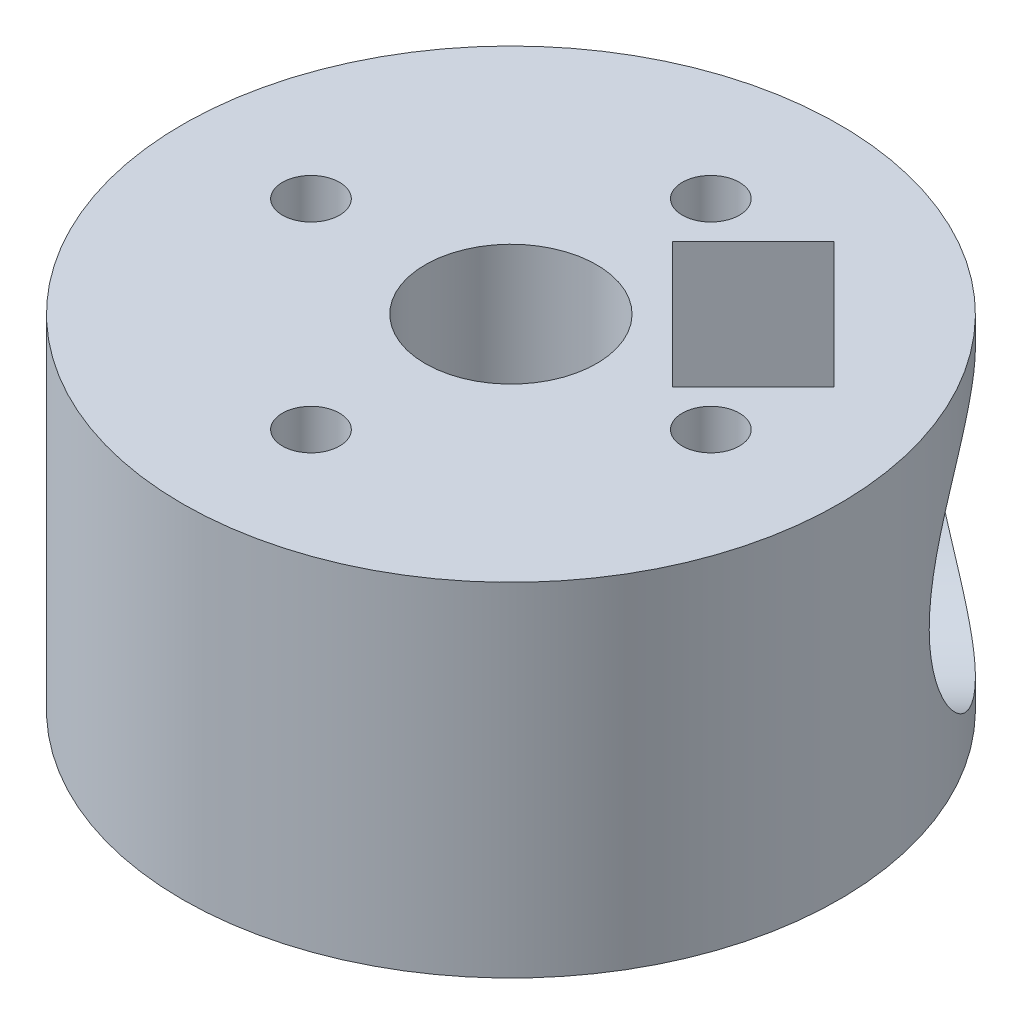
ISO-10303-21;
HEADER;
FILE_DESCRIPTION(('STEP AP214'),'2;1');
FILE_NAME('part.step','',(''),(''),'','','');
FILE_SCHEMA(('AUTOMOTIVE_DESIGN { 1 0 10303 214 1 1 1 1 }'));
ENDSEC;
DATA;
#1=APPLICATION_CONTEXT('core data for automotive mechanical design processes');
#2=APPLICATION_PROTOCOL_DEFINITION('international standard','automotive_design',2000,#1);
#3=PRODUCT_CONTEXT('',#1,'mechanical');
#4=PRODUCT('Part','Part','',(#3));
#5=PRODUCT_RELATED_PRODUCT_CATEGORY('part','',(#4));
#6=PRODUCT_DEFINITION_FORMATION('','',#4);
#7=PRODUCT_DEFINITION_CONTEXT('part definition',#1,'design');
#8=PRODUCT_DEFINITION('design','',#6,#7);
#9=PRODUCT_DEFINITION_SHAPE('','',#8);
#10=(LENGTH_UNIT() NAMED_UNIT(*) SI_UNIT(.MILLI.,.METRE.));
#11=(NAMED_UNIT(*) PLANE_ANGLE_UNIT() SI_UNIT($,.RADIAN.));
#12=(NAMED_UNIT(*) SI_UNIT($,.STERADIAN.) SOLID_ANGLE_UNIT());
#13=UNCERTAINTY_MEASURE_WITH_UNIT(LENGTH_MEASURE(1.E-05),#10,'distance_accuracy_value','');
#14=(GEOMETRIC_REPRESENTATION_CONTEXT(3) GLOBAL_UNCERTAINTY_ASSIGNED_CONTEXT((#13)) GLOBAL_UNIT_ASSIGNED_CONTEXT((#10,
#11,#12)) REPRESENTATION_CONTEXT('',''));
#15=CARTESIAN_POINT('',(0.,0.,0.));
#16=DIRECTION('',(0.,0.,1.));
#17=DIRECTION('',(1.,0.,0.));
#18=AXIS2_PLACEMENT_3D('',#15,#16,#17);
#19=CARTESIAN_POINT('',(1.41421356237309,6.,-1.4142135623731));
#20=DIRECTION('',(0.707106781186546,0.,-0.707106781186549));
#21=DIRECTION('',(-0.707106781186549,0.,-0.707106781186546));
#22=AXIS2_PLACEMENT_3D('',#19,#20,#21);
#23=CYLINDRICAL_SURFACE('',#22,1.5);
#24=CARTESIAN_POINT('',(5.65685424949237,6.,-5.65685424949239));
#25=DIRECTION('',(-0.707106781186546,0.,0.707106781186549));
#26=DIRECTION('',(0.707106781186549,0.,0.707106781186546));
#27=AXIS2_PLACEMENT_3D('',#24,#25,#26);
#28=CIRCLE('',#27,1.5);
#29=CARTESIAN_POINT('',(6.71751442127219,6.,-4.59619407771257));
#30=VERTEX_POINT('',#29);
#31=EDGE_CURVE('E154',#30,#30,#28,.T.);
#32=ORIENTED_EDGE('',*,*,#31,.T.);
#33=EDGE_LOOP('',(#32));
#34=FACE_BOUND('',#33,.T.);
#35=CARTESIAN_POINT('',(7.07106781186546,6.,-7.07106781186549));
#36=DIRECTION('',(0.707106781186546,0.,-0.707106781186549));
#37=DIRECTION('',(-0.707106781186549,0.,-0.707106781186546));
#38=AXIS2_PLACEMENT_3D('',#35,#36,#37);
#39=CIRCLE('',#38,1.5);
#40=CARTESIAN_POINT('',(6.01040764008564,6.,-8.13172798364531));
#41=VERTEX_POINT('',#40);
#42=EDGE_CURVE('E157',#41,#41,#39,.F.);
#43=ORIENTED_EDGE('',*,*,#42,.F.);
#44=EDGE_LOOP('',(#43));
#45=FACE_BOUND('',#44,.T.);
#46=ADVANCED_FACE('F33',(#34,#45),#23,.F.);
#47=CARTESIAN_POINT('',(0.,12.,0.));
#48=DIRECTION('',(0.,1.,0.));
#49=DIRECTION('',(0.,0.,1.));
#50=AXIS2_PLACEMENT_3D('',#47,#48,#49);
#51=PLANE('',#50);
#52=CARTESIAN_POINT('',(3.96862982246381E-13,12.,7.));
#53=DIRECTION('',(0.,1.,0.));
#54=DIRECTION('',(0.,0.,1.));
#55=AXIS2_PLACEMENT_3D('',#52,#53,#54);
#56=CIRCLE('',#55,1.00000000000043);
#57=CARTESIAN_POINT('',(3.96862982246381E-13,12.,8.00000000000043));
#58=VERTEX_POINT('',#57);
#59=EDGE_CURVE('E129',#58,#58,#56,.T.);
#60=ORIENTED_EDGE('',*,*,#59,.F.);
#61=EDGE_LOOP('',(#60));
#62=FACE_BOUND('',#61,.T.);
#63=CARTESIAN_POINT('',(0.,12.,-7.));
#64=DIRECTION('',(0.,1.,0.));
#65=DIRECTION('',(0.,0.,1.));
#66=AXIS2_PLACEMENT_3D('',#63,#64,#65);
#67=CIRCLE('',#66,1.);
#68=CARTESIAN_POINT('',(0.,12.,-6.));
#69=VERTEX_POINT('',#68);
#70=EDGE_CURVE('E141',#69,#69,#67,.T.);
#71=ORIENTED_EDGE('',*,*,#70,.F.);
#72=EDGE_LOOP('',(#71));
#73=FACE_BOUND('',#72,.T.);
#74=CARTESIAN_POINT('',(0.,12.,0.));
#75=DIRECTION('',(0.,1.,0.));
#76=DIRECTION('',(0.,0.,1.));
#77=AXIS2_PLACEMENT_3D('',#74,#75,#76);
#78=CIRCLE('',#77,11.5);
#79=CARTESIAN_POINT('',(0.,12.,11.5));
#80=VERTEX_POINT('',#79);
#81=EDGE_CURVE('E11',#80,#80,#78,.T.);
#82=ORIENTED_EDGE('',*,*,#81,.T.);
#83=EDGE_LOOP('',(#82));
#84=FACE_BOUND('',#83,.T.);
#85=CARTESIAN_POINT('',(0.,12.,0.));
#86=DIRECTION('',(0.,1.,0.));
#87=DIRECTION('',(0.,0.,1.));
#88=AXIS2_PLACEMENT_3D('',#85,#86,#87);
#89=CIRCLE('',#88,3.);
#90=CARTESIAN_POINT('',(0.,12.,3.));
#91=VERTEX_POINT('',#90);
#92=EDGE_CURVE('E147',#91,#91,#89,.T.);
#93=ORIENTED_EDGE('',*,*,#92,.F.);
#94=EDGE_LOOP('',(#93));
#95=FACE_BOUND('',#94,.T.);
#96=CARTESIAN_POINT('',(7.0000000000002,12.,-1.98094713253425E-13));
#97=DIRECTION('',(0.,1.,0.));
#98=DIRECTION('',(0.,0.,1.));
#99=AXIS2_PLACEMENT_3D('',#96,#97,#98);
#100=CIRCLE('',#99,1.00000000000016);
#101=CARTESIAN_POINT('',(7.0000000000002,12.,0.999999999999957));
#102=VERTEX_POINT('',#101);
#103=EDGE_CURVE('E135',#102,#102,#100,.T.);
#104=ORIENTED_EDGE('',*,*,#103,.F.);
#105=EDGE_LOOP('',(#104));
#106=FACE_BOUND('',#105,.T.);
#107=CARTESIAN_POINT('',(-6.9999999999998,12.,1.98951966012828E-13));
#108=DIRECTION('',(0.,1.,0.));
#109=DIRECTION('',(0.,0.,1.));
#110=AXIS2_PLACEMENT_3D('',#107,#108,#109);
#111=CIRCLE('',#110,1.00000000000032);
#112=CARTESIAN_POINT('',(-6.9999999999998,12.,1.00000000000052));
#113=VERTEX_POINT('',#112);
#114=EDGE_CURVE('E123',#113,#113,#111,.T.);
#115=ORIENTED_EDGE('',*,*,#114,.F.);
#116=EDGE_LOOP('',(#115));
#117=FACE_BOUND('',#116,.T.);
#118=DIRECTION('',(0.707106781186549,0.,0.707106781186546));
#119=VECTOR('',#118,1.);
#120=CARTESIAN_POINT('',(5.65685424949237,12.,-5.65685424949239));
#121=LINE('',#120,#119);
#122=CARTESIAN_POINT('',(3.4471455582844,12.,-7.86656294070035));
#123=VERTEX_POINT('',#122);
#124=CARTESIAN_POINT('',(7.86656294070033,12.,-3.44714555828444));
#125=VERTEX_POINT('',#124);
#126=EDGE_CURVE('E113',#123,#125,#121,.T.);
#127=ORIENTED_EDGE('',*,*,#126,.T.);
#128=DIRECTION('',(-0.707106781186546,0.,0.707106781186549));
#129=VECTOR('',#128,1.);
#130=CARTESIAN_POINT('',(2.20970869120797,12.,2.20970869120796));
#131=LINE('',#130,#129);
#132=CARTESIAN_POINT('',(5.03813581595415,12.,-0.61871843353824));
#133=VERTEX_POINT('',#132);
#134=EDGE_CURVE('E54',#125,#133,#131,.T.);
#135=ORIENTED_EDGE('',*,*,#134,.T.);
#136=DIRECTION('',(0.707106781186549,0.,0.707106781186546));
#137=VECTOR('',#136,1.);
#138=CARTESIAN_POINT('',(2.82842712474618,12.,-2.8284271247462));
#139=LINE('',#138,#137);
#140=CARTESIAN_POINT('',(0.61871843353822,12.,-5.03813581595415));
#141=VERTEX_POINT('',#140);
#142=EDGE_CURVE('E97',#141,#133,#139,.T.);
#143=ORIENTED_EDGE('',*,*,#142,.F.);
#144=DIRECTION('',(-0.707106781186546,0.,0.707106781186549));
#145=VECTOR('',#144,1.);
#146=CARTESIAN_POINT('',(-2.20970869120797,12.,-2.20970869120796));
#147=LINE('',#146,#145);
#148=EDGE_CURVE('E100',#123,#141,#147,.T.);
#149=ORIENTED_EDGE('',*,*,#148,.F.);
#150=EDGE_LOOP('',(#127,#135,#143,#149));
#151=FACE_BOUND('',#150,.T.);
#152=ADVANCED_FACE('F186',(#62,#73,#84,#95,#106,#117,#151),#51,.T.);
#153=CARTESIAN_POINT('',(0.,0.,0.));
#154=DIRECTION('',(0.,1.,0.));
#155=DIRECTION('',(0.,0.,1.));
#156=AXIS2_PLACEMENT_3D('',#153,#154,#155);
#157=PLANE('',#156);
#158=CARTESIAN_POINT('',(-6.9999999999998,0.,1.98951966012828E-13));
#159=DIRECTION('',(0.,1.,0.));
#160=DIRECTION('',(0.,0.,1.));
#161=AXIS2_PLACEMENT_3D('',#158,#159,#160);
#162=CIRCLE('',#161,1.00000000000032);
#163=CARTESIAN_POINT('',(-6.9999999999998,0.,1.00000000000052));
#164=VERTEX_POINT('',#163);
#165=EDGE_CURVE('E119',#164,#164,#162,.T.);
#166=ORIENTED_EDGE('',*,*,#165,.T.);
#167=EDGE_LOOP('',(#166));
#168=FACE_BOUND('',#167,.T.);
#169=CARTESIAN_POINT('',(3.96862982246381E-13,0.,7.));
#170=DIRECTION('',(0.,1.,0.));
#171=DIRECTION('',(0.,0.,1.));
#172=AXIS2_PLACEMENT_3D('',#169,#170,#171);
#173=CIRCLE('',#172,1.00000000000043);
#174=CARTESIAN_POINT('',(3.96862982246381E-13,0.,8.00000000000043));
#175=VERTEX_POINT('',#174);
#176=EDGE_CURVE('E126',#175,#175,#173,.T.);
#177=ORIENTED_EDGE('',*,*,#176,.T.);
#178=EDGE_LOOP('',(#177));
#179=FACE_BOUND('',#178,.T.);
#180=CARTESIAN_POINT('',(7.0000000000002,0.,-1.98094713253425E-13));
#181=DIRECTION('',(0.,1.,0.));
#182=DIRECTION('',(0.,0.,1.));
#183=AXIS2_PLACEMENT_3D('',#180,#181,#182);
#184=CIRCLE('',#183,1.00000000000016);
#185=CARTESIAN_POINT('',(7.0000000000002,0.,0.999999999999957));
#186=VERTEX_POINT('',#185);
#187=EDGE_CURVE('E132',#186,#186,#184,.T.);
#188=ORIENTED_EDGE('',*,*,#187,.T.);
#189=EDGE_LOOP('',(#188));
#190=FACE_BOUND('',#189,.T.);
#191=CARTESIAN_POINT('',(0.,0.,-7.));
#192=DIRECTION('',(0.,1.,0.));
#193=DIRECTION('',(0.,0.,1.));
#194=AXIS2_PLACEMENT_3D('',#191,#192,#193);
#195=CIRCLE('',#194,1.);
#196=CARTESIAN_POINT('',(0.,0.,-6.));
#197=VERTEX_POINT('',#196);
#198=EDGE_CURVE('E138',#197,#197,#195,.T.);
#199=ORIENTED_EDGE('',*,*,#198,.T.);
#200=EDGE_LOOP('',(#199));
#201=FACE_BOUND('',#200,.T.);
#202=CARTESIAN_POINT('',(0.,0.,0.));
#203=DIRECTION('',(0.,1.,0.));
#204=DIRECTION('',(0.,0.,1.));
#205=AXIS2_PLACEMENT_3D('',#202,#203,#204);
#206=CIRCLE('',#205,3.);
#207=CARTESIAN_POINT('',(0.,0.,3.));
#208=VERTEX_POINT('',#207);
#209=EDGE_CURVE('E144',#208,#208,#206,.T.);
#210=ORIENTED_EDGE('',*,*,#209,.T.);
#211=EDGE_LOOP('',(#210));
#212=FACE_BOUND('',#211,.T.);
#213=CARTESIAN_POINT('',(0.,0.,0.));
#214=DIRECTION('',(0.,1.,0.));
#215=DIRECTION('',(0.,0.,1.));
#216=AXIS2_PLACEMENT_3D('',#213,#214,#215);
#217=CIRCLE('',#216,11.5);
#218=CARTESIAN_POINT('',(0.,0.,11.5));
#219=VERTEX_POINT('',#218);
#220=EDGE_CURVE('E46',#219,#219,#217,.T.);
#221=ORIENTED_EDGE('',*,*,#220,.F.);
#222=EDGE_LOOP('',(#221));
#223=FACE_BOUND('',#222,.T.);
#224=DIRECTION('',(-0.707106781186546,0.,0.707106781186549));
#225=VECTOR('',#224,1.);
#226=CARTESIAN_POINT('',(2.20970869120797,0.,2.20970869120796));
#227=LINE('',#226,#225);
#228=CARTESIAN_POINT('',(7.86656294070033,0.,-3.44714555828444));
#229=VERTEX_POINT('',#228);
#230=CARTESIAN_POINT('',(5.03813581595415,0.,-0.61871843353824));
#231=VERTEX_POINT('',#230);
#232=EDGE_CURVE('E88',#229,#231,#227,.T.);
#233=ORIENTED_EDGE('',*,*,#232,.F.);
#234=DIRECTION('',(0.707106781186549,0.,0.707106781186546));
#235=VECTOR('',#234,1.);
#236=CARTESIAN_POINT('',(5.65685424949237,0.,-5.65685424949239));
#237=LINE('',#236,#235);
#238=CARTESIAN_POINT('',(3.4471455582844,0.,-7.86656294070035));
#239=VERTEX_POINT('',#238);
#240=EDGE_CURVE('E80',#239,#229,#237,.T.);
#241=ORIENTED_EDGE('',*,*,#240,.F.);
#242=DIRECTION('',(-0.707106781186546,0.,0.707106781186549));
#243=VECTOR('',#242,1.);
#244=CARTESIAN_POINT('',(-2.20970869120797,0.,-2.20970869120796));
#245=LINE('',#244,#243);
#246=CARTESIAN_POINT('',(0.61871843353822,0.,-5.03813581595415));
#247=VERTEX_POINT('',#246);
#248=EDGE_CURVE('E62',#239,#247,#245,.T.);
#249=ORIENTED_EDGE('',*,*,#248,.T.);
#250=DIRECTION('',(0.707106781186549,0.,0.707106781186546));
#251=VECTOR('',#250,1.);
#252=CARTESIAN_POINT('',(2.82842712474618,0.,-2.8284271247462));
#253=LINE('',#252,#251);
#254=EDGE_CURVE('E92',#247,#231,#253,.T.);
#255=ORIENTED_EDGE('',*,*,#254,.T.);
#256=EDGE_LOOP('',(#233,#241,#249,#255));
#257=FACE_BOUND('',#256,.T.);
#258=ADVANCED_FACE('F95',(#168,#179,#190,#201,#212,#223,#257),#157,.F.);
#259=CARTESIAN_POINT('',(0.,12.,0.));
#260=DIRECTION('',(0.,-1.,0.));
#261=DIRECTION('',(0.,0.,-1.));
#262=AXIS2_PLACEMENT_3D('',#259,#260,#261);
#263=CYLINDRICAL_SURFACE('',#262,11.5);
#264=CARTESIAN_POINT('',(3.78737535200564,6.,-10.8584431638711));
#265=CARTESIAN_POINT('',(3.78737687744004,5.86721367544331,-10.8584432302089));
#266=CARTESIAN_POINT('',(3.79293321073784,5.73438715301474,-10.8565095495698));
#267=CARTESIAN_POINT('',(3.81505823777842,5.46971112375947,-10.8487540084161));
#268=CARTESIAN_POINT('',(3.83163371083152,5.33786226894867,-10.8429297542916));
#269=CARTESIAN_POINT('',(3.87552590130048,5.07592596729272,-10.8273192223792));
#270=CARTESIAN_POINT('',(3.90286434032583,4.94584263625513,-10.8175249311491));
#271=CARTESIAN_POINT('',(3.9677912237892,4.68858833953484,-10.7938790259039));
#272=CARTESIAN_POINT('',(4.00538400533308,4.5614186309041,-10.7800256949211));
#273=CARTESIAN_POINT('',(4.08997638395233,4.31146352157035,-10.7482148334112));
#274=CARTESIAN_POINT('',(4.13693011934463,4.18866005711802,-10.7302772540427));
#275=CARTESIAN_POINT('',(4.2396339601799,3.94749697808217,-10.6901142975366));
#276=CARTESIAN_POINT('',(4.2953873854108,3.82913906158126,-10.6678873014579));
#277=CARTESIAN_POINT('',(4.47464040471465,3.48185276723528,-10.5945389924449));
#278=CARTESIAN_POINT('',(4.61023617450071,3.26041345113585,-10.5367135956214));
#279=CARTESIAN_POINT('',(4.91627079405315,2.8293268968776,-10.3976066261771));
#280=CARTESIAN_POINT('',(5.08834157237044,2.62124657641373,-10.3150994660101));
#281=CARTESIAN_POINT('',(5.45419762366187,2.23695387934173,-10.1263991871386));
#282=CARTESIAN_POINT('',(5.64799166234894,2.06075444273752,-10.0201964896288));
#283=CARTESIAN_POINT('',(5.95387331727454,1.82007796735817,-9.83953311425247));
#284=CARTESIAN_POINT('',(6.06100560432311,1.74231014221498,-9.77398471195223));
#285=CARTESIAN_POINT('',(6.27799752445804,1.59741634111028,-9.63603851876587));
#286=CARTESIAN_POINT('',(6.38785599378365,1.5302859116282,-9.56364361465955));
#287=CARTESIAN_POINT('',(6.60918034625239,1.40727439881845,-9.41205258846386));
#288=CARTESIAN_POINT('',(6.72064634733438,1.35139414542181,-9.33285596522268));
#289=CARTESIAN_POINT('',(6.94396363689881,1.25149004381348,-9.1679125051226));
#290=CARTESIAN_POINT('',(7.05581469860376,1.20746013291621,-9.08216904658652));
#291=CARTESIAN_POINT('',(7.27256133966446,1.13384129321487,-8.90943184442934));
#292=CARTESIAN_POINT('',(7.3774975876979,1.10358506388163,-8.82277323936267));
#293=CARTESIAN_POINT('',(7.58567579781886,1.05441823318835,-8.64443724894539));
#294=CARTESIAN_POINT('',(7.6889185083036,1.0355024813419,-8.5527621625984));
#295=CARTESIAN_POINT('',(7.89279060287613,1.00922281790837,-8.36499008707933));
#296=CARTESIAN_POINT('',(7.99342042015829,1.00185697926644,-8.26889383831437));
#297=CARTESIAN_POINT('',(8.19120493527918,0.998761472378054,-8.07301247962711));
#298=CARTESIAN_POINT('',(8.28835978219572,1.00303130434792,-7.97322752832622));
#299=CARTESIAN_POINT('',(8.47210019324658,1.0224833451559,-7.77755231381731));
#300=CARTESIAN_POINT('',(8.55895912849268,1.03692176615685,-7.6818437014221));
#301=CARTESIAN_POINT('',(8.7284701803399,1.075745164492,-7.48867995121926));
#302=CARTESIAN_POINT('',(8.81112090294056,1.10013341397482,-7.39122424894507));
#303=CARTESIAN_POINT('',(8.97173320547294,1.15860838494433,-7.1954168919098));
#304=CARTESIAN_POINT('',(9.04969633319406,1.19269188363189,-7.09706554536849));
#305=CARTESIAN_POINT('',(9.20066297784026,1.27023624451878,-6.90023366008075));
#306=CARTESIAN_POINT('',(9.27366459140153,1.31370067908264,-6.80175308636257));
#307=CARTESIAN_POINT('',(9.48696188150925,1.4590676204919,-6.50441584311125));
#308=CARTESIAN_POINT('',(9.61924633991019,1.57509603955706,-6.30649774787668));
#309=CARTESIAN_POINT('',(9.8617578605947,1.84078921845846,-5.92013202027943));
#310=CARTESIAN_POINT('',(9.97197691812261,1.99046614344851,-5.73168784330734));
#311=CARTESIAN_POINT('',(10.1786295515564,2.33236858824338,-5.35674299265472));
#312=CARTESIAN_POINT('',(10.2733857331568,2.52695876492468,-5.17147154429644));
#313=CARTESIAN_POINT('',(10.4398583925741,2.94674191157694,-4.82660416574328));
#314=CARTESIAN_POINT('',(10.5115643525057,3.17194878553589,-4.66701997325523));
#315=CARTESIAN_POINT('',(10.6043501573388,3.53339348060299,-4.45019935172785));
#316=CARTESIAN_POINT('',(10.6332065477813,3.66042827552803,-4.38061239285826));
#317=CARTESIAN_POINT('',(10.6854446902352,3.920618408913,-4.25160107741005));
#318=CARTESIAN_POINT('',(10.7088287059562,4.05377118923306,-4.19217252144563));
#319=CARTESIAN_POINT('',(10.7503426409733,4.32526407423334,-4.08453969409401));
#320=CARTESIAN_POINT('',(10.7684747684834,4.46360197106106,-4.03633070699636));
#321=CARTESIAN_POINT('',(10.7996897919347,4.74448493075656,-3.95205320321039));
#322=CARTESIAN_POINT('',(10.812773186634,4.88702957654642,-3.91598348734364));
#323=CARTESIAN_POINT('',(10.8333056622908,5.16522836352021,-3.85880109310167));
#324=CARTESIAN_POINT('',(10.8410802577236,5.30068249765708,-3.83683061748985));
#325=CARTESIAN_POINT('',(10.8524559181639,5.57314282063746,-3.80453628907254));
#326=CARTESIAN_POINT('',(10.8560573030858,5.71014888969792,-3.79421154351791));
#327=CARTESIAN_POINT('',(10.8591236987814,5.98454185161798,-3.78542657818588));
#328=CARTESIAN_POINT('',(10.858590079267,6.12192860330409,-3.78696242960866));
#329=CARTESIAN_POINT('',(10.8533845200918,6.39597503128938,-3.80185559445022));
#330=CARTESIAN_POINT('',(10.8487127286786,6.53263473345825,-3.81521248438684));
#331=CARTESIAN_POINT('',(10.8356748439743,6.79423732538208,-3.85207765899575));
#332=CARTESIAN_POINT('',(10.8276021554153,6.91930948531488,-3.87477696282243));
#333=CARTESIAN_POINT('',(10.8077882112033,7.16705999700827,-3.92970147456106));
#334=CARTESIAN_POINT('',(10.7960457855284,7.28973757203145,-3.96192972040745));
#335=CARTESIAN_POINT('',(10.7551707476803,7.65296788495639,-4.07216575226065));
#336=CARTESIAN_POINT('',(10.7203811467114,7.88891151249165,-4.16375312013894));
#337=CARTESIAN_POINT('',(10.6328150622012,8.35292442809324,-4.38265126631863));
#338=CARTESIAN_POINT('',(10.5793143663093,8.58019018552211,-4.511356825067));
#339=CARTESIAN_POINT('',(10.4532659813711,9.0110422534181,-4.79619730775062));
#340=CARTESIAN_POINT('',(10.3807095597208,9.21461764549664,-4.95234479652579));
#341=CARTESIAN_POINT('',(10.2074182916849,9.6114888329872,-5.30091047521197));
#342=CARTESIAN_POINT('',(10.1047331862008,9.80220457559978,-5.49532926199688));
#343=CARTESIAN_POINT('',(9.9312735622845,10.0600651110857,-5.79944177189412));
#344=CARTESIAN_POINT('',(9.87017110336493,10.1413580778674,-5.90296139349613));
#345=CARTESIAN_POINT('',(9.74137016977195,10.293977454773,-6.11317146699841));
#346=CARTESIAN_POINT('',(9.67367456277942,10.3653081653977,-6.21986052644681));
#347=CARTESIAN_POINT('',(9.53119428855228,10.4978637943352,-6.43608721565741));
#348=CARTESIAN_POINT('',(9.45636455664987,10.559016714135,-6.54563927997171));
#349=CARTESIAN_POINT('',(9.30016444367699,10.6700207046688,-6.7657325452552));
#350=CARTESIAN_POINT('',(9.21879692989206,10.7198766936618,-6.87627329391577));
#351=CARTESIAN_POINT('',(9.04979928919305,10.8077686920851,-7.09721561287153));
#352=CARTESIAN_POINT('',(8.96217112367202,10.8458083836314,-7.20761721582475));
#353=CARTESIAN_POINT('',(8.78108176655837,10.9096371958746,-7.42716931745425));
#354=CARTESIAN_POINT('',(8.68762106262647,10.9354273392124,-7.5363199198263));
#355=CARTESIAN_POINT('',(8.50271665058163,10.9729680631498,-7.74413839202284));
#356=CARTESIAN_POINT('',(8.4116491180022,10.9856280084666,-7.84297764251519));
#357=CARTESIAN_POINT('',(8.22564696791436,11.0000552641035,-8.0378403134167));
#358=CARTESIAN_POINT('',(8.13071106495634,11.0018189234082,-8.13386277928198));
#359=CARTESIAN_POINT('',(7.93778701820546,10.994424406382,-8.32224153968746));
#360=CARTESIAN_POINT('',(7.83980063184466,10.9852724093458,-8.41459987790054));
#361=CARTESIAN_POINT('',(7.64149914027405,10.9561570899227,-8.59508434522409));
#362=CARTESIAN_POINT('',(7.54118318284757,10.9361897494175,-8.6832088881385));
#363=CARTESIAN_POINT('',(7.34332702214111,10.8867100552783,-8.85108285110236));
#364=CARTESIAN_POINT('',(7.24584493820593,10.8576293045971,-8.93102816919398));
#365=CARTESIAN_POINT('',(7.05034882534118,10.790019301731,-9.0861537386286));
#366=CARTESIAN_POINT('',(6.95233462325253,10.7514867680836,-9.16133232362872));
#367=CARTESIAN_POINT('',(6.65874536047574,10.622213935834,-9.37924828730865));
#368=CARTESIAN_POINT('',(6.46345997888474,10.5177571284495,-9.51450351516155));
#369=CARTESIAN_POINT('',(6.07155834016298,10.2700543404893,-9.76951677072245));
#370=CARTESIAN_POINT('',(5.87529007671924,10.1252521482122,-9.8882824734374));
#371=CARTESIAN_POINT('',(5.49755333656927,9.8031608570199,-10.1031765213194));
#372=CARTESIAN_POINT('',(5.31609092918046,9.62585853115835,-10.199295613208));
#373=CARTESIAN_POINT('',(4.96172767187941,9.22800079509796,-10.3765798613989));
#374=CARTESIAN_POINT('',(4.7904909012279,9.00519815386177,-10.4560817877621));
#375=CARTESIAN_POINT('',(4.55859389265138,8.64999061974762,-10.5582385437719));
#376=CARTESIAN_POINT('',(4.48540149967959,8.52797153460714,-10.5894612525544));
#377=CARTESIAN_POINT('',(4.34837783830249,8.27759196725381,-10.6464597921683));
#378=CARTESIAN_POINT('',(4.28454232165914,8.1492343984694,-10.6722380972432));
#379=CARTESIAN_POINT('',(4.16720227942496,7.88684191648256,-10.7186013723409));
#380=CARTESIAN_POINT('',(4.11370675341583,7.75280218031389,-10.7391818230597));
#381=CARTESIAN_POINT('',(4.01810310202655,7.48012455117603,-10.7753172061965));
#382=CARTESIAN_POINT('',(3.97598931400375,7.34148898341211,-10.7908746384194));
#383=CARTESIAN_POINT('',(3.90406157227898,7.0610059233453,-10.8171053232745));
#384=CARTESIAN_POINT('',(3.87421527246083,6.91916793167065,-10.8277914285369));
#385=CARTESIAN_POINT('',(3.82733226434902,6.63319105158952,-10.8444526993945));
#386=CARTESIAN_POINT('',(3.8102858152228,6.4890539982822,-10.850431447511));
#387=CARTESIAN_POINT('',(3.7956779009357,6.28713774853353,-10.8555442766418));
#388=CARTESIAN_POINT('',(3.79256608745703,6.22976319619201,-10.8566314739004));
#389=CARTESIAN_POINT('',(3.78841446199447,6.11492827342879,-10.8580809104744));
#390=CARTESIAN_POINT('',(3.78737469182084,6.05746790129881,-10.8584431351612));
#391=CARTESIAN_POINT('',(3.78737535200564,6.,-10.8584431638711));
#392=B_SPLINE_CURVE_WITH_KNOTS('',3,(#264,#265,#266,#267,#268,#269,#270,#271,#272,#273,#274,
#275,#276,#277,#278,#279,#280,#281,#282,#283,#284,#285,#286,#287,#288,#289,#290,#291,#292,#293,
#294,#295,#296,#297,#298,#299,#300,#301,#302,#303,#304,#305,#306,#307,#308,#309,#310,#311,#312,
#313,#314,#315,#316,#317,#318,#319,#320,#321,#322,#323,#324,#325,#326,#327,#328,#329,#330,#331,
#332,#333,#334,#335,#336,#337,#338,#339,#340,#341,#342,#343,#344,#345,#346,#347,#348,#349,#350,
#351,#352,#353,#354,#355,#356,#357,#358,#359,#360,#361,#362,#363,#364,#365,#366,#367,#368,#369,
#370,#371,#372,#373,#374,#375,#376,#377,#378,#379,#380,#381,#382,#383,#384,#385,#386,#387,#388,
#389,#390,#391),.UNSPECIFIED.,.T.,.F.,(4,2,2,2,2,2,2,2,2,2,2,2,2,2,2,2,2,2,2,2,2,2,2,2,2,2,2,2,
2,2,2,2,2,2,2,2,2,2,2,2,2,2,2,2,2,2,2,2,2,2,2,2,2,2,2,2,2,2,2,2,2,2,2,4),(0.,0.398299323730929,
0.796843920394837,1.1961970095886,1.59571926901091,1.99333025057608,2.39109159576241,
3.18567129502025,4.02920240955863,4.87307513724939,5.3157698675023,5.75827876382173,
6.20082029228858,6.64313498239574,7.06083406732191,7.47834330253271,7.89578287065407,
8.31320450889439,8.70289551473386,9.09271477967603,9.48240461586426,9.87224311293028,
10.6630359649453,11.4541151783257,12.3051368122687,13.1565462205247,13.5991419155385,
14.0415542009377,14.4837801983065,14.9259624975293,15.3377453530155,15.7494966395246,
16.1611115400679,16.5727116953321,16.9543756065375,17.3361613279564,18.0991530102751,
18.8957235953231,19.6926598610183,20.5614210229826,20.9963412516732,21.4310731500922,
21.8687604715412,22.3062568726893,22.7436168070374,23.1809402224236,23.5854012791666,
23.9899978512151,24.3943654919725,24.7988834666109,25.1865743697392,25.5744000620702,
26.3494057657736,27.1598743875405,27.9706735901849,28.8423107452586,29.2788939510519,
29.7152783198856,30.1520408094568,30.5885855992394,31.0239718355357,31.4590264011908,
31.6314008113172,31.8037786996274),.UNSPECIFIED.);
#393=CARTESIAN_POINT('',(3.78737535200564,6.,-10.8584431638711));
#394=VERTEX_POINT('',#393);
#395=EDGE_CURVE('E38',#394,#394,#392,.T.);
#396=ORIENTED_EDGE('',*,*,#395,.T.);
#397=EDGE_LOOP('',(#396));
#398=FACE_BOUND('',#397,.T.);
#399=ORIENTED_EDGE('',*,*,#81,.F.);
#400=EDGE_LOOP('',(#399));
#401=FACE_BOUND('',#400,.T.);
#402=ORIENTED_EDGE('',*,*,#220,.T.);
#403=EDGE_LOOP('',(#402));
#404=FACE_BOUND('',#403,.T.);
#405=ADVANCED_FACE('F35',(#398,#401,#404),#263,.T.);
#406=CARTESIAN_POINT('',(0.,12.,0.));
#407=DIRECTION('',(0.,-1.,0.));
#408=DIRECTION('',(0.,0.,-1.));
#409=AXIS2_PLACEMENT_3D('',#406,#407,#408);
#410=CYLINDRICAL_SURFACE('',#409,3.);
#411=CARTESIAN_POINT('',(0.776457135307557,6.,-2.89777747886721));
#412=CARTESIAN_POINT('',(0.776465807945199,5.92183828770712,-2.89777843642086));
#413=CARTESIAN_POINT('',(0.783337885586091,5.84357788271243,-2.89596075365292));
#414=CARTESIAN_POINT('',(0.810238787422548,5.68945910298427,-2.88854556363685));
#415=CARTESIAN_POINT('',(0.830295257550596,5.61360612743489,-2.88294011324794));
#416=CARTESIAN_POINT('',(0.881825990933501,5.46682250348409,-2.86759385571556));
#417=CARTESIAN_POINT('',(0.913239525995616,5.39586802128962,-2.85787499736417));
#418=CARTESIAN_POINT('',(0.985522074791564,5.25986369700492,-2.83375960105534));
#419=CARTESIAN_POINT('',(1.02639160004347,5.19481417460631,-2.81936281002992));
#420=CARTESIAN_POINT('',(1.11931695974479,5.06654140716374,-2.78384605508351));
#421=CARTESIAN_POINT('',(1.17201739854081,5.00391129648968,-2.7622695134035));
#422=CARTESIAN_POINT('',(1.28389309696414,4.88788741738994,-2.7120800954357));
#423=CARTESIAN_POINT('',(1.3430715624082,4.83449825612472,-2.68346372649268));
#424=CARTESIAN_POINT('',(1.4697835351575,4.73494927327851,-2.61633504151045));
#425=CARTESIAN_POINT('',(1.53761134146162,4.6895193482107,-2.57728569203884));
#426=CARTESIAN_POINT('',(1.67515420911278,4.61228872013136,-2.4900743247597));
#427=CARTESIAN_POINT('',(1.74486804977895,4.58047941579424,-2.44191808567333));
#428=CARTESIAN_POINT('',(1.87817425418938,4.53374300804835,-2.34071742954988));
#429=CARTESIAN_POINT('',(1.94184923030434,4.5177757104667,-2.28826464060799));
#430=CARTESIAN_POINT('',(2.06564121032913,4.49975082198744,-2.1771603544596));
#431=CARTESIAN_POINT('',(2.12576034519837,4.49768481480643,-2.11851262971613));
#432=CARTESIAN_POINT('',(2.23530137136982,4.50712001095552,-2.00231140292521));
#433=CARTESIAN_POINT('',(2.28519887174932,4.51745702328183,-1.94510625043173));
#434=CARTESIAN_POINT('',(2.37912040040672,4.54932126585699,-1.82903282067121));
#435=CARTESIAN_POINT('',(2.42314398886575,4.57084933346433,-1.77016441926512));
#436=CARTESIAN_POINT('',(2.50530608030927,4.62462384913472,-1.65187898356768));
#437=CARTESIAN_POINT('',(2.54335473361967,4.6570144697581,-1.59246562724668));
#438=CARTESIAN_POINT('',(2.6127806933699,4.73139512430224,-1.47580220064366));
#439=CARTESIAN_POINT('',(2.64415560358889,4.77338859495352,-1.41855291342132));
#440=CARTESIAN_POINT('',(2.70321718660422,4.87034302729952,-1.30277736945864));
#441=CARTESIAN_POINT('',(2.7302748716661,4.92615454248901,-1.2446419510183));
#442=CARTESIAN_POINT('',(2.77749540009896,5.04688458739527,-1.13537205134786));
#443=CARTESIAN_POINT('',(2.79765294762601,5.11181005841109,-1.08424296543309));
#444=CARTESIAN_POINT('',(2.83296699306693,5.25397228863613,-0.988467637856783));
#445=CARTESIAN_POINT('',(2.84772461492292,5.33172903458132,-0.944439272066024));
#446=CARTESIAN_POINT('',(2.87128516634125,5.4944065070385,-0.870203141463107));
#447=CARTESIAN_POINT('',(2.88009431275189,5.57931964952634,-0.839980958308256));
#448=CARTESIAN_POINT('',(2.8920242052622,5.74682176692419,-0.797898740855287));
#449=CARTESIAN_POINT('',(2.89554041189933,5.82906167856533,-0.784773377993312));
#450=CARTESIAN_POINT('',(2.89846195751578,5.99460201227481,-0.773923684249228));
#451=CARTESIAN_POINT('',(2.89787020033614,6.07790164367968,-0.776188474338468));
#452=CARTESIAN_POINT('',(2.89282271219332,6.23348087786809,-0.79476043293404));
#453=CARTESIAN_POINT('',(2.88879674637904,6.30596917666189,-0.809504390277581));
#454=CARTESIAN_POINT('',(2.87718549622091,6.44755167940644,-0.849847525365753));
#455=CARTESIAN_POINT('',(2.86959905914146,6.51664477611991,-0.875450218468111));
#456=CARTESIAN_POINT('',(2.85000428601381,6.65311699635404,-0.937320913584773));
#457=CARTESIAN_POINT('',(2.83780742241691,6.72026852528033,-0.974027961374807));
#458=CARTESIAN_POINT('',(2.80846718922543,6.84820390730849,-1.05564763070854));
#459=CARTESIAN_POINT('',(2.79132127696574,6.90898446526992,-1.10056446582025));
#460=CARTESIAN_POINT('',(2.74893115939282,7.03046815128532,-1.20283404947151));
#461=CARTESIAN_POINT('',(2.72293857041294,7.09019572607649,-1.26104068458325));
#462=CARTESIAN_POINT('',(2.66304918010131,7.19911835699039,-1.38303494861758));
#463=CARTESIAN_POINT('',(2.62914971686414,7.24830985534581,-1.44682445252411));
#464=CARTESIAN_POINT('',(2.55189425785636,7.33586058892515,-1.57919386501898));
#465=CARTESIAN_POINT('',(2.50831229866665,7.37389967731637,-1.64785576996501));
#466=CARTESIAN_POINT('',(2.41231873467998,7.43570685578609,-1.78542113059001));
#467=CARTESIAN_POINT('',(2.35991493507781,7.45948747704946,-1.85432432047735));
#468=CARTESIAN_POINT('',(2.25247602694357,7.49005284626199,-1.98311144359732));
#469=CARTESIAN_POINT('',(2.19812351338379,7.49819681381417,-2.04324285223116));
#470=CARTESIAN_POINT('',(2.08451046937594,7.5012648981816,-2.15902393796182));
#471=CARTESIAN_POINT('',(2.02525166408007,7.49619364278535,-2.21467517691624));
#472=CARTESIAN_POINT('',(1.90791731594303,7.47387538980656,-2.31635207595354));
#473=CARTESIAN_POINT('',(1.85002110919702,7.45745272611349,-2.36277036625902));
#474=CARTESIAN_POINT('',(1.73362251777721,7.41400950104554,-2.44945348099618));
#475=CARTESIAN_POINT('',(1.67512004734522,7.38698741985982,-2.48971742182762));
#476=CARTESIAN_POINT('',(1.5568750791499,7.32190942175104,-2.5654004226216));
#477=CARTESIAN_POINT('',(1.49718656380225,7.28343101518824,-2.60053861020872));
#478=CARTESIAN_POINT('',(1.38109270507128,7.19706310371143,-2.66401345602037));
#479=CARTESIAN_POINT('',(1.32468888511395,7.14916927632649,-2.69234697700719));
#480=CARTESIAN_POINT('',(1.21166858581717,7.03980429146595,-2.74520076947935));
#481=CARTESIAN_POINT('',(1.15558958126822,6.97745626878421,-2.76906092274574));
#482=CARTESIAN_POINT('',(1.05214039162086,6.84382391830535,-2.81000068113221));
#483=CARTESIAN_POINT('',(1.00477791984151,6.77253176869848,-2.8270742961439));
#484=CARTESIAN_POINT('',(0.920191613571822,6.62004503012857,-2.85575022521723));
#485=CARTESIAN_POINT('',(0.88333547926552,6.5386087033069,-2.86716258468163));
#486=CARTESIAN_POINT('',(0.824963295294618,6.37000139349033,-2.88450805289951));
#487=CARTESIAN_POINT('',(0.803395954954616,6.28285066663097,-2.89045950183027));
#488=CARTESIAN_POINT('',(0.785870399492763,6.16229196652201,-2.89524136224008));
#489=CARTESIAN_POINT('',(0.782348442320766,6.12994815840318,-2.89619347565166));
#490=CARTESIAN_POINT('',(0.777639926487402,6.06507527897664,-2.89746135588973));
#491=CARTESIAN_POINT('',(0.776453524059144,6.03254619542119,-2.89777708014605));
#492=CARTESIAN_POINT('',(0.776457135307557,6.,-2.89777747886721));
#493=B_SPLINE_CURVE_WITH_KNOTS('',3,(#411,#412,#413,#414,#415,#416,#417,#418,#419,#420,#421,
#422,#423,#424,#425,#426,#427,#428,#429,#430,#431,#432,#433,#434,#435,#436,#437,#438,#439,#440,
#441,#442,#443,#444,#445,#446,#447,#448,#449,#450,#451,#452,#453,#454,#455,#456,#457,#458,#459,
#460,#461,#462,#463,#464,#465,#466,#467,#468,#469,#470,#471,#472,#473,#474,#475,#476,#477,#478,
#479,#480,#481,#482,#483,#484,#485,#486,#487,#488,#489,#490,#491,#492),.UNSPECIFIED.,.T.,.F.,(4,
2,2,2,2,2,2,2,2,2,2,2,2,2,2,2,2,2,2,2,2,2,2,2,2,2,2,2,2,2,2,2,2,2,2,2,2,2,2,2,4),(0.,
0.234348183892073,0.469189339237207,0.702792893878329,0.936409088167725,1.18929346874735,
1.44230356626556,1.71236838358145,1.98226240445837,2.23295227451903,2.4834903552906,
2.71224146226808,2.94100968776183,3.1729430209672,3.40495949025408,3.65890787185336,
3.91305072368878,4.18333262594173,4.45333161317557,4.70193436281317,4.95036139782559,
5.17161275136038,5.39293578654094,5.62450944609131,5.85620229330071,6.1171011537092,
6.37808797467303,6.64596272119449,6.91360169713157,7.1566840558423,7.39968130190957,
7.62666637307239,7.85368400268019,8.09041126079208,8.32724745151078,8.58765362775101,
8.84828914267731,9.11716123557907,9.3851269950414,9.48270202777964,9.58028358741811),.UNSPECIFIED.);
#494=CARTESIAN_POINT('',(0.776457135307557,6.,-2.89777747886721));
#495=VERTEX_POINT('',#494);
#496=EDGE_CURVE('E103',#495,#495,#493,.T.);
#497=ORIENTED_EDGE('',*,*,#496,.F.);
#498=EDGE_LOOP('',(#497));
#499=FACE_BOUND('',#498,.T.);
#500=ORIENTED_EDGE('',*,*,#92,.T.);
#501=EDGE_LOOP('',(#500));
#502=FACE_BOUND('',#501,.T.);
#503=ORIENTED_EDGE('',*,*,#209,.F.);
#504=EDGE_LOOP('',(#503));
#505=FACE_BOUND('',#504,.T.);
#506=ADVANCED_FACE('F176',(#499,#502,#505),#410,.F.);
#507=CARTESIAN_POINT('',(0.,12.,-7.));
#508=DIRECTION('',(0.,-1.,0.));
#509=DIRECTION('',(0.,0.,-1.));
#510=AXIS2_PLACEMENT_3D('',#507,#508,#509);
#511=CYLINDRICAL_SURFACE('',#510,1.);
#512=ORIENTED_EDGE('',*,*,#70,.T.);
#513=EDGE_LOOP('',(#512));
#514=FACE_BOUND('',#513,.T.);
#515=ORIENTED_EDGE('',*,*,#198,.F.);
#516=EDGE_LOOP('',(#515));
#517=FACE_BOUND('',#516,.T.);
#518=ADVANCED_FACE('F179',(#514,#517),#511,.F.);
#519=CARTESIAN_POINT('',(7.0000000000002,12.,-1.98094713253425E-13));
#520=DIRECTION('',(0.,-1.,0.));
#521=DIRECTION('',(0.,0.,-1.));
#522=AXIS2_PLACEMENT_3D('',#519,#520,#521);
#523=CYLINDRICAL_SURFACE('',#522,1.00000000000016);
#524=ORIENTED_EDGE('',*,*,#103,.T.);
#525=EDGE_LOOP('',(#524));
#526=FACE_BOUND('',#525,.T.);
#527=ORIENTED_EDGE('',*,*,#187,.F.);
#528=EDGE_LOOP('',(#527));
#529=FACE_BOUND('',#528,.T.);
#530=ADVANCED_FACE('F232',(#526,#529),#523,.F.);
#531=CARTESIAN_POINT('',(3.96862982246381E-13,12.,7.));
#532=DIRECTION('',(0.,-1.,0.));
#533=DIRECTION('',(0.,0.,-1.));
#534=AXIS2_PLACEMENT_3D('',#531,#532,#533);
#535=CYLINDRICAL_SURFACE('',#534,1.00000000000043);
#536=ORIENTED_EDGE('',*,*,#59,.T.);
#537=EDGE_LOOP('',(#536));
#538=FACE_BOUND('',#537,.T.);
#539=ORIENTED_EDGE('',*,*,#176,.F.);
#540=EDGE_LOOP('',(#539));
#541=FACE_BOUND('',#540,.T.);
#542=ADVANCED_FACE('F228',(#538,#541),#535,.F.);
#543=CARTESIAN_POINT('',(-6.9999999999998,12.,1.98951966012828E-13));
#544=DIRECTION('',(0.,-1.,0.));
#545=DIRECTION('',(0.,0.,-1.));
#546=AXIS2_PLACEMENT_3D('',#543,#544,#545);
#547=CYLINDRICAL_SURFACE('',#546,1.00000000000032);
#548=ORIENTED_EDGE('',*,*,#114,.T.);
#549=EDGE_LOOP('',(#548));
#550=FACE_BOUND('',#549,.T.);
#551=ORIENTED_EDGE('',*,*,#165,.F.);
#552=EDGE_LOOP('',(#551));
#553=FACE_BOUND('',#552,.T.);
#554=ADVANCED_FACE('F225',(#550,#553),#547,.F.);
#555=CARTESIAN_POINT('',(2.20970869120797,0.,2.20970869120796));
#556=DIRECTION('',(-0.707106781186549,0.,-0.707106781186546));
#557=DIRECTION('',(-0.707106781186546,0.,0.707106781186549));
#558=AXIS2_PLACEMENT_3D('',#555,#556,#557);
#559=PLANE('',#558);
#560=ORIENTED_EDGE('',*,*,#134,.F.);
#561=DIRECTION('',(0.,1.,0.));
#562=VECTOR('',#561,1.);
#563=CARTESIAN_POINT('',(7.86656294070033,0.,-3.44714555828444));
#564=LINE('',#563,#562);
#565=EDGE_CURVE('E83',#229,#125,#564,.T.);
#566=ORIENTED_EDGE('',*,*,#565,.F.);
#567=ORIENTED_EDGE('',*,*,#232,.T.);
#568=DIRECTION('',(0.,1.,0.));
#569=VECTOR('',#568,1.);
#570=CARTESIAN_POINT('',(5.03813581595415,0.,-0.61871843353824));
#571=LINE('',#570,#569);
#572=EDGE_CURVE('E117',#231,#133,#571,.T.);
#573=ORIENTED_EDGE('',*,*,#572,.T.);
#574=EDGE_LOOP('',(#560,#566,#567,#573));
#575=FACE_BOUND('',#574,.T.);
#576=ADVANCED_FACE('F90',(#575),#559,.T.);
#577=CARTESIAN_POINT('',(2.82842712474618,0.,-2.8284271247462));
#578=DIRECTION('',(-0.707106781186546,0.,0.707106781186549));
#579=DIRECTION('',(0.707106781186549,0.,0.707106781186546));
#580=AXIS2_PLACEMENT_3D('',#577,#578,#579);
#581=PLANE('',#580);
#582=CARTESIAN_POINT('',(2.82842712474618,6.,-2.8284271247462));
#583=DIRECTION('',(-0.707106781186546,0.,0.707106781186549));
#584=DIRECTION('',(0.707106781186549,0.,0.707106781186546));
#585=AXIS2_PLACEMENT_3D('',#582,#583,#584);
#586=CIRCLE('',#585,1.5);
#587=CARTESIAN_POINT('',(3.88908729652601,6.,-1.76776695296638));
#588=VERTEX_POINT('',#587);
#589=EDGE_CURVE('E156',#588,#588,#586,.T.);
#590=ORIENTED_EDGE('',*,*,#589,.T.);
#591=EDGE_LOOP('',(#590));
#592=FACE_BOUND('',#591,.T.);
#593=ORIENTED_EDGE('',*,*,#142,.T.);
#594=ORIENTED_EDGE('',*,*,#572,.F.);
#595=ORIENTED_EDGE('',*,*,#254,.F.);
#596=DIRECTION('',(0.,1.,0.));
#597=VECTOR('',#596,1.);
#598=CARTESIAN_POINT('',(0.61871843353822,0.,-5.03813581595415));
#599=LINE('',#598,#597);
#600=EDGE_CURVE('E120',#247,#141,#599,.T.);
#601=ORIENTED_EDGE('',*,*,#600,.T.);
#602=EDGE_LOOP('',(#593,#594,#595,#601));
#603=FACE_BOUND('',#602,.T.);
#604=ADVANCED_FACE('F219',(#592,#603),#581,.F.);
#605=CARTESIAN_POINT('',(-2.20970869120797,0.,-2.20970869120796));
#606=DIRECTION('',(-0.707106781186549,0.,-0.707106781186546));
#607=DIRECTION('',(-0.707106781186546,0.,0.707106781186549));
#608=AXIS2_PLACEMENT_3D('',#605,#606,#607);
#609=PLANE('',#608);
#610=ORIENTED_EDGE('',*,*,#148,.T.);
#611=ORIENTED_EDGE('',*,*,#600,.F.);
#612=ORIENTED_EDGE('',*,*,#248,.F.);
#613=DIRECTION('',(0.,1.,0.));
#614=VECTOR('',#613,1.);
#615=CARTESIAN_POINT('',(3.4471455582844,0.,-7.86656294070035));
#616=LINE('',#615,#614);
#617=EDGE_CURVE('E85',#239,#123,#616,.T.);
#618=ORIENTED_EDGE('',*,*,#617,.T.);
#619=EDGE_LOOP('',(#610,#611,#612,#618));
#620=FACE_BOUND('',#619,.T.);
#621=ADVANCED_FACE('F213',(#620),#609,.F.);
#622=CARTESIAN_POINT('',(5.65685424949237,0.,-5.65685424949239));
#623=DIRECTION('',(-0.707106781186546,0.,0.707106781186549));
#624=DIRECTION('',(0.707106781186549,0.,0.707106781186546));
#625=AXIS2_PLACEMENT_3D('',#622,#623,#624);
#626=PLANE('',#625);
#627=ORIENTED_EDGE('',*,*,#31,.F.);
#628=EDGE_LOOP('',(#627));
#629=FACE_BOUND('',#628,.T.);
#630=ORIENTED_EDGE('',*,*,#126,.F.);
#631=ORIENTED_EDGE('',*,*,#617,.F.);
#632=ORIENTED_EDGE('',*,*,#240,.T.);
#633=ORIENTED_EDGE('',*,*,#565,.T.);
#634=EDGE_LOOP('',(#630,#631,#632,#633));
#635=FACE_BOUND('',#634,.T.);
#636=ADVANCED_FACE('F82',(#629,#635),#626,.T.);
#637=ORIENTED_EDGE('',*,*,#496,.T.);
#638=EDGE_LOOP('',(#637));
#639=FACE_BOUND('',#638,.T.);
#640=ORIENTED_EDGE('',*,*,#589,.F.);
#641=EDGE_LOOP('',(#640));
#642=FACE_BOUND('',#641,.T.);
#643=ADVANCED_FACE('F173',(#639,#642),#23,.F.);
#644=CARTESIAN_POINT('',(7.07106781186546,6.,-7.07106781186549));
#645=DIRECTION('',(0.707106781186546,0.,-0.707106781186549));
#646=DIRECTION('',(-0.707106781186549,0.,-0.707106781186546));
#647=AXIS2_PLACEMENT_3D('',#644,#645,#646);
#648=CYLINDRICAL_SURFACE('',#647,5.);
#649=CARTESIAN_POINT('',(7.07106781186546,6.,-7.07106781186549));
#650=DIRECTION('',(0.707106781186546,0.,-0.707106781186549));
#651=DIRECTION('',(-0.707106781186549,0.,-0.707106781186546));
#652=AXIS2_PLACEMENT_3D('',#649,#650,#651);
#653=CIRCLE('',#652,5.);
#654=CARTESIAN_POINT('',(3.53553390593272,6.,-10.6066017177982));
#655=VERTEX_POINT('',#654);
#656=EDGE_CURVE('E159',#655,#655,#653,.T.);
#657=ORIENTED_EDGE('',*,*,#656,.F.);
#658=EDGE_LOOP('',(#657));
#659=FACE_BOUND('',#658,.T.);
#660=ORIENTED_EDGE('',*,*,#395,.F.);
#661=EDGE_LOOP('',(#660));
#662=FACE_BOUND('',#661,.T.);
#663=ADVANCED_FACE('F206',(#659,#662),#648,.F.);
#664=CARTESIAN_POINT('',(7.07106781186546,6.,-7.07106781186549));
#665=DIRECTION('',(0.707106781186546,0.,-0.707106781186549));
#666=DIRECTION('',(-0.707106781186549,0.,-0.707106781186546));
#667=AXIS2_PLACEMENT_3D('',#664,#665,#666);
#668=PLANE('',#667);
#669=ORIENTED_EDGE('',*,*,#656,.T.);
#670=EDGE_LOOP('',(#669));
#671=FACE_BOUND('',#670,.T.);
#672=ORIENTED_EDGE('',*,*,#42,.T.);
#673=EDGE_LOOP('',(#672));
#674=FACE_BOUND('',#673,.T.);
#675=ADVANCED_FACE('F211',(#671,#674),#668,.T.);
#676=CLOSED_SHELL('',(#46,#152,#258,#405,#506,#518,#530,#542,#554,#576,#604,#621,#636,#643,#663,#675));
#677=MANIFOLD_SOLID_BREP('B2',#676);
#678=ADVANCED_BREP_SHAPE_REPRESENTATION('',(#18,#677),#14);
#679=SHAPE_DEFINITION_REPRESENTATION(#9,#678);
ENDSEC;
END-ISO-10303-21;
